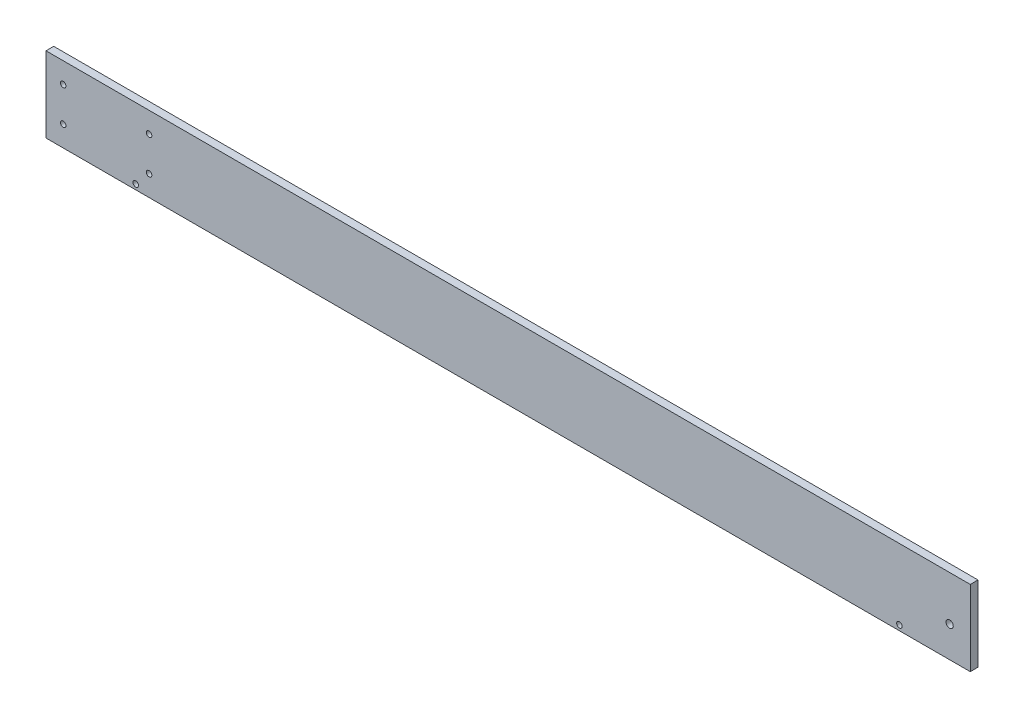
ISO-10303-21;
HEADER;
FILE_DESCRIPTION(('STEP AP214'),'2;1');
FILE_NAME('part.step','',(''),(''),'','','');
FILE_SCHEMA(('AUTOMOTIVE_DESIGN { 1 0 10303 214 1 1 1 1 }'));
ENDSEC;
DATA;
#1=APPLICATION_CONTEXT('core data for automotive mechanical design processes');
#2=APPLICATION_PROTOCOL_DEFINITION('international standard','automotive_design',2000,#1);
#3=PRODUCT_CONTEXT('',#1,'mechanical');
#4=PRODUCT('Part','Part','',(#3));
#5=PRODUCT_RELATED_PRODUCT_CATEGORY('part','',(#4));
#6=PRODUCT_DEFINITION_FORMATION('','',#4);
#7=PRODUCT_DEFINITION_CONTEXT('part definition',#1,'design');
#8=PRODUCT_DEFINITION('design','',#6,#7);
#9=PRODUCT_DEFINITION_SHAPE('','',#8);
#10=(LENGTH_UNIT() NAMED_UNIT(*) SI_UNIT(.MILLI.,.METRE.));
#11=(NAMED_UNIT(*) PLANE_ANGLE_UNIT() SI_UNIT($,.RADIAN.));
#12=(NAMED_UNIT(*) SI_UNIT($,.STERADIAN.) SOLID_ANGLE_UNIT());
#13=UNCERTAINTY_MEASURE_WITH_UNIT(LENGTH_MEASURE(1.E-05),#10,'distance_accuracy_value','');
#14=(GEOMETRIC_REPRESENTATION_CONTEXT(3) GLOBAL_UNCERTAINTY_ASSIGNED_CONTEXT((#13)) GLOBAL_UNIT_ASSIGNED_CONTEXT((#10,
#11,#12)) REPRESENTATION_CONTEXT('',''));
#15=CARTESIAN_POINT('',(0.,0.,0.));
#16=DIRECTION('',(0.,0.,1.));
#17=DIRECTION('',(1.,0.,0.));
#18=AXIS2_PLACEMENT_3D('',#15,#16,#17);
#19=CARTESIAN_POINT('',(0.,0.,4.5));
#20=DIRECTION('',(0.,0.,-1.));
#21=DIRECTION('',(-1.,0.,0.));
#22=AXIS2_PLACEMENT_3D('',#19,#20,#21);
#23=PLANE('',#22);
#24=DIRECTION('',(0.,1.,0.));
#25=VECTOR('',#24,1.);
#26=CARTESIAN_POINT('',(269.,-22.,4.5));
#27=LINE('',#26,#25);
#28=CARTESIAN_POINT('',(269.,-22.,4.5));
#29=VERTEX_POINT('',#28);
#30=CARTESIAN_POINT('',(269.,22.,4.5));
#31=VERTEX_POINT('',#30);
#32=EDGE_CURVE('E85',#29,#31,#27,.T.);
#33=ORIENTED_EDGE('',*,*,#32,.T.);
#34=DIRECTION('',(-1.,0.,0.));
#35=VECTOR('',#34,1.);
#36=CARTESIAN_POINT('',(-269.,22.,4.5));
#37=LINE('',#36,#35);
#38=CARTESIAN_POINT('',(-269.,22.,4.5));
#39=VERTEX_POINT('',#38);
#40=EDGE_CURVE('E80',#31,#39,#37,.T.);
#41=ORIENTED_EDGE('',*,*,#40,.T.);
#42=DIRECTION('',(0.,-1.,0.));
#43=VECTOR('',#42,1.);
#44=CARTESIAN_POINT('',(-269.,-22.,4.5));
#45=LINE('',#44,#43);
#46=CARTESIAN_POINT('',(-269.,-22.,4.5));
#47=VERTEX_POINT('',#46);
#48=EDGE_CURVE('E83',#39,#47,#45,.T.);
#49=ORIENTED_EDGE('',*,*,#48,.T.);
#50=DIRECTION('',(1.,0.,0.));
#51=VECTOR('',#50,1.);
#52=CARTESIAN_POINT('',(-269.,-22.,4.5));
#53=LINE('',#52,#51);
#54=EDGE_CURVE('E50',#47,#29,#53,.T.);
#55=ORIENTED_EDGE('',*,*,#54,.T.);
#56=EDGE_LOOP('',(#33,#41,#49,#55));
#57=FACE_BOUND('',#56,.T.);
#58=CARTESIAN_POINT('',(257.,-3.99999999999952,4.5));
#59=DIRECTION('',(0.,0.,1.));
#60=DIRECTION('',(1.,0.,0.));
#61=AXIS2_PLACEMENT_3D('',#58,#59,#60);
#62=CIRCLE('',#61,2.10000000000005);
#63=CARTESIAN_POINT('',(259.1,-3.99999999999952,4.5));
#64=VERTEX_POINT('',#63);
#65=EDGE_CURVE('E100',#64,#64,#62,.T.);
#66=ORIENTED_EDGE('',*,*,#65,.F.);
#67=EDGE_LOOP('',(#66));
#68=FACE_BOUND('',#67,.T.);
#69=CARTESIAN_POINT('',(-259.,10.,4.5));
#70=DIRECTION('',(0.,0.,1.));
#71=DIRECTION('',(1.,0.,0.));
#72=AXIS2_PLACEMENT_3D('',#69,#70,#71);
#73=CIRCLE('',#72,1.59999999999996);
#74=CARTESIAN_POINT('',(-257.4,10.,4.5));
#75=VERTEX_POINT('',#74);
#76=EDGE_CURVE('E115',#75,#75,#73,.T.);
#77=ORIENTED_EDGE('',*,*,#76,.F.);
#78=EDGE_LOOP('',(#77));
#79=FACE_BOUND('',#78,.T.);
#80=CARTESIAN_POINT('',(-209.,10.,4.5));
#81=DIRECTION('',(0.,0.,1.));
#82=DIRECTION('',(1.,0.,0.));
#83=AXIS2_PLACEMENT_3D('',#80,#81,#82);
#84=CIRCLE('',#83,1.59999999999996);
#85=CARTESIAN_POINT('',(-207.4,10.,4.5));
#86=VERTEX_POINT('',#85);
#87=EDGE_CURVE('E121',#86,#86,#84,.T.);
#88=ORIENTED_EDGE('',*,*,#87,.F.);
#89=EDGE_LOOP('',(#88));
#90=FACE_BOUND('',#89,.T.);
#91=CARTESIAN_POINT('',(-208.999999999999,-10.,4.5));
#92=DIRECTION('',(0.,0.,1.));
#93=DIRECTION('',(1.,0.,0.));
#94=AXIS2_PLACEMENT_3D('',#91,#92,#93);
#95=CIRCLE('',#94,1.59999999999996);
#96=CARTESIAN_POINT('',(-207.399999999999,-10.,4.5));
#97=VERTEX_POINT('',#96);
#98=EDGE_CURVE('E127',#97,#97,#95,.T.);
#99=ORIENTED_EDGE('',*,*,#98,.F.);
#100=EDGE_LOOP('',(#99));
#101=FACE_BOUND('',#100,.T.);
#102=CARTESIAN_POINT('',(-258.999999999999,-10.,4.5));
#103=DIRECTION('',(0.,0.,1.));
#104=DIRECTION('',(1.,0.,0.));
#105=AXIS2_PLACEMENT_3D('',#102,#103,#104);
#106=CIRCLE('',#105,1.59999999999996);
#107=CARTESIAN_POINT('',(-257.399999999999,-10.,4.5));
#108=VERTEX_POINT('',#107);
#109=EDGE_CURVE('E133',#108,#108,#106,.T.);
#110=ORIENTED_EDGE('',*,*,#109,.F.);
#111=EDGE_LOOP('',(#110));
#112=FACE_BOUND('',#111,.T.);
#113=CARTESIAN_POINT('',(227.75,-18.9999999999995,4.5));
#114=DIRECTION('',(0.,0.,1.));
#115=DIRECTION('',(1.,0.,0.));
#116=AXIS2_PLACEMENT_3D('',#113,#114,#115);
#117=CIRCLE('',#116,1.60000000000005);
#118=CARTESIAN_POINT('',(229.35,-18.9999999999995,4.5));
#119=VERTEX_POINT('',#118);
#120=EDGE_CURVE('E139',#119,#119,#117,.T.);
#121=ORIENTED_EDGE('',*,*,#120,.F.);
#122=EDGE_LOOP('',(#121));
#123=FACE_BOUND('',#122,.T.);
#124=CARTESIAN_POINT('',(-216.75,-19.0000000000007,4.5));
#125=DIRECTION('',(0.,0.,1.));
#126=DIRECTION('',(1.,0.,0.));
#127=AXIS2_PLACEMENT_3D('',#124,#125,#126);
#128=CIRCLE('',#127,1.60000000000005);
#129=CARTESIAN_POINT('',(-215.15,-19.0000000000007,4.5));
#130=VERTEX_POINT('',#129);
#131=EDGE_CURVE('E145',#130,#130,#128,.T.);
#132=ORIENTED_EDGE('',*,*,#131,.F.);
#133=EDGE_LOOP('',(#132));
#134=FACE_BOUND('',#133,.T.);
#135=ADVANCED_FACE('F33',(#57,#68,#79,#90,#101,#112,#123,#134),#23,.F.);
#136=CARTESIAN_POINT('',(0.,0.,0.));
#137=DIRECTION('',(0.,0.,-1.));
#138=DIRECTION('',(-1.,0.,0.));
#139=AXIS2_PLACEMENT_3D('',#136,#137,#138);
#140=PLANE('',#139);
#141=CARTESIAN_POINT('',(227.75,-18.9999999999995,0.));
#142=DIRECTION('',(0.,0.,1.));
#143=DIRECTION('',(1.,0.,0.));
#144=AXIS2_PLACEMENT_3D('',#141,#142,#143);
#145=CIRCLE('',#144,1.60000000000005);
#146=CARTESIAN_POINT('',(229.35,-18.9999999999995,0.));
#147=VERTEX_POINT('',#146);
#148=EDGE_CURVE('E142',#147,#147,#145,.T.);
#149=ORIENTED_EDGE('',*,*,#148,.T.);
#150=EDGE_LOOP('',(#149));
#151=FACE_BOUND('',#150,.T.);
#152=CARTESIAN_POINT('',(-208.999999999999,-10.,0.));
#153=DIRECTION('',(0.,0.,1.));
#154=DIRECTION('',(1.,0.,0.));
#155=AXIS2_PLACEMENT_3D('',#152,#153,#154);
#156=CIRCLE('',#155,1.59999999999996);
#157=CARTESIAN_POINT('',(-207.399999999999,-10.,0.));
#158=VERTEX_POINT('',#157);
#159=EDGE_CURVE('E130',#158,#158,#156,.T.);
#160=ORIENTED_EDGE('',*,*,#159,.T.);
#161=EDGE_LOOP('',(#160));
#162=FACE_BOUND('',#161,.T.);
#163=CARTESIAN_POINT('',(-259.,10.,0.));
#164=DIRECTION('',(0.,0.,1.));
#165=DIRECTION('',(1.,0.,0.));
#166=AXIS2_PLACEMENT_3D('',#163,#164,#165);
#167=CIRCLE('',#166,1.59999999999996);
#168=CARTESIAN_POINT('',(-257.4,10.,0.));
#169=VERTEX_POINT('',#168);
#170=EDGE_CURVE('E118',#169,#169,#167,.T.);
#171=ORIENTED_EDGE('',*,*,#170,.T.);
#172=EDGE_LOOP('',(#171));
#173=FACE_BOUND('',#172,.T.);
#174=DIRECTION('',(0.,1.,0.));
#175=VECTOR('',#174,1.);
#176=CARTESIAN_POINT('',(269.,-22.,0.));
#177=LINE('',#176,#175);
#178=CARTESIAN_POINT('',(269.,-22.,0.));
#179=VERTEX_POINT('',#178);
#180=CARTESIAN_POINT('',(269.,22.,0.));
#181=VERTEX_POINT('',#180);
#182=EDGE_CURVE('E97',#179,#181,#177,.T.);
#183=ORIENTED_EDGE('',*,*,#182,.F.);
#184=DIRECTION('',(1.,0.,0.));
#185=VECTOR('',#184,1.);
#186=CARTESIAN_POINT('',(-269.,-22.,0.));
#187=LINE('',#186,#185);
#188=CARTESIAN_POINT('',(-269.,-22.,0.));
#189=VERTEX_POINT('',#188);
#190=EDGE_CURVE('E73',#189,#179,#187,.T.);
#191=ORIENTED_EDGE('',*,*,#190,.F.);
#192=DIRECTION('',(0.,-1.,0.));
#193=VECTOR('',#192,1.);
#194=CARTESIAN_POINT('',(-269.,-22.,0.));
#195=LINE('',#194,#193);
#196=CARTESIAN_POINT('',(-269.,22.,0.));
#197=VERTEX_POINT('',#196);
#198=EDGE_CURVE('E67',#197,#189,#195,.T.);
#199=ORIENTED_EDGE('',*,*,#198,.F.);
#200=DIRECTION('',(-1.,0.,0.));
#201=VECTOR('',#200,1.);
#202=CARTESIAN_POINT('',(-269.,22.,0.));
#203=LINE('',#202,#201);
#204=EDGE_CURVE('E89',#181,#197,#203,.T.);
#205=ORIENTED_EDGE('',*,*,#204,.F.);
#206=EDGE_LOOP('',(#183,#191,#199,#205));
#207=FACE_BOUND('',#206,.T.);
#208=CARTESIAN_POINT('',(257.,-3.99999999999952,0.));
#209=DIRECTION('',(0.,0.,1.));
#210=DIRECTION('',(1.,0.,0.));
#211=AXIS2_PLACEMENT_3D('',#208,#209,#210);
#212=CIRCLE('',#211,2.10000000000005);
#213=CARTESIAN_POINT('',(259.1,-3.99999999999952,0.));
#214=VERTEX_POINT('',#213);
#215=EDGE_CURVE('E112',#214,#214,#212,.T.);
#216=ORIENTED_EDGE('',*,*,#215,.T.);
#217=EDGE_LOOP('',(#216));
#218=FACE_BOUND('',#217,.T.);
#219=CARTESIAN_POINT('',(-209.,10.,0.));
#220=DIRECTION('',(0.,0.,1.));
#221=DIRECTION('',(1.,0.,0.));
#222=AXIS2_PLACEMENT_3D('',#219,#220,#221);
#223=CIRCLE('',#222,1.59999999999996);
#224=CARTESIAN_POINT('',(-207.4,10.,0.));
#225=VERTEX_POINT('',#224);
#226=EDGE_CURVE('E124',#225,#225,#223,.T.);
#227=ORIENTED_EDGE('',*,*,#226,.T.);
#228=EDGE_LOOP('',(#227));
#229=FACE_BOUND('',#228,.T.);
#230=CARTESIAN_POINT('',(-258.999999999999,-10.,0.));
#231=DIRECTION('',(0.,0.,1.));
#232=DIRECTION('',(1.,0.,0.));
#233=AXIS2_PLACEMENT_3D('',#230,#231,#232);
#234=CIRCLE('',#233,1.59999999999996);
#235=CARTESIAN_POINT('',(-257.399999999999,-10.,0.));
#236=VERTEX_POINT('',#235);
#237=EDGE_CURVE('E136',#236,#236,#234,.T.);
#238=ORIENTED_EDGE('',*,*,#237,.T.);
#239=EDGE_LOOP('',(#238));
#240=FACE_BOUND('',#239,.T.);
#241=CARTESIAN_POINT('',(-216.75,-19.0000000000007,0.));
#242=DIRECTION('',(0.,0.,1.));
#243=DIRECTION('',(1.,0.,0.));
#244=AXIS2_PLACEMENT_3D('',#241,#242,#243);
#245=CIRCLE('',#244,1.60000000000005);
#246=CARTESIAN_POINT('',(-215.15,-19.0000000000007,0.));
#247=VERTEX_POINT('',#246);
#248=EDGE_CURVE('E148',#247,#247,#245,.T.);
#249=ORIENTED_EDGE('',*,*,#248,.T.);
#250=EDGE_LOOP('',(#249));
#251=FACE_BOUND('',#250,.T.);
#252=ADVANCED_FACE('F108',(#151,#162,#173,#207,#218,#229,#240,#251),#140,.T.);
#253=CARTESIAN_POINT('',(269.,-22.,4.5));
#254=DIRECTION('',(-1.,0.,0.));
#255=DIRECTION('',(0.,0.,1.));
#256=AXIS2_PLACEMENT_3D('',#253,#254,#255);
#257=PLANE('',#256);
#258=ORIENTED_EDGE('',*,*,#182,.T.);
#259=DIRECTION('',(0.,0.,-1.));
#260=VECTOR('',#259,1.);
#261=CARTESIAN_POINT('',(269.,22.,4.5));
#262=LINE('',#261,#260);
#263=EDGE_CURVE('E11',#31,#181,#262,.T.);
#264=ORIENTED_EDGE('',*,*,#263,.F.);
#265=ORIENTED_EDGE('',*,*,#32,.F.);
#266=DIRECTION('',(0.,0.,-1.));
#267=VECTOR('',#266,1.);
#268=CARTESIAN_POINT('',(269.,-22.,4.5));
#269=LINE('',#268,#267);
#270=EDGE_CURVE('E93',#29,#179,#269,.T.);
#271=ORIENTED_EDGE('',*,*,#270,.T.);
#272=EDGE_LOOP('',(#258,#264,#265,#271));
#273=FACE_BOUND('',#272,.T.);
#274=ADVANCED_FACE('F35',(#273),#257,.F.);
#275=CARTESIAN_POINT('',(-269.,22.,4.5));
#276=DIRECTION('',(0.,-1.,0.));
#277=DIRECTION('',(1.,0.,0.));
#278=AXIS2_PLACEMENT_3D('',#275,#276,#277);
#279=PLANE('',#278);
#280=ORIENTED_EDGE('',*,*,#204,.T.);
#281=DIRECTION('',(0.,0.,-1.));
#282=VECTOR('',#281,1.);
#283=CARTESIAN_POINT('',(-269.,22.,4.5));
#284=LINE('',#283,#282);
#285=EDGE_CURVE('E42',#39,#197,#284,.T.);
#286=ORIENTED_EDGE('',*,*,#285,.F.);
#287=ORIENTED_EDGE('',*,*,#40,.F.);
#288=ORIENTED_EDGE('',*,*,#263,.T.);
#289=EDGE_LOOP('',(#280,#286,#287,#288));
#290=FACE_BOUND('',#289,.T.);
#291=ADVANCED_FACE('F88',(#290),#279,.F.);
#292=CARTESIAN_POINT('',(-269.,-22.,4.5));
#293=DIRECTION('',(1.,0.,0.));
#294=DIRECTION('',(0.,0.,-1.));
#295=AXIS2_PLACEMENT_3D('',#292,#293,#294);
#296=PLANE('',#295);
#297=ORIENTED_EDGE('',*,*,#198,.T.);
#298=DIRECTION('',(0.,0.,-1.));
#299=VECTOR('',#298,1.);
#300=CARTESIAN_POINT('',(-269.,-22.,4.5));
#301=LINE('',#300,#299);
#302=EDGE_CURVE('E90',#47,#189,#301,.T.);
#303=ORIENTED_EDGE('',*,*,#302,.F.);
#304=ORIENTED_EDGE('',*,*,#48,.F.);
#305=ORIENTED_EDGE('',*,*,#285,.T.);
#306=EDGE_LOOP('',(#297,#303,#304,#305));
#307=FACE_BOUND('',#306,.T.);
#308=ADVANCED_FACE('F91',(#307),#296,.F.);
#309=CARTESIAN_POINT('',(-269.,-22.,4.5));
#310=DIRECTION('',(0.,1.,0.));
#311=DIRECTION('',(-1.,0.,0.));
#312=AXIS2_PLACEMENT_3D('',#309,#310,#311);
#313=PLANE('',#312);
#314=ORIENTED_EDGE('',*,*,#190,.T.);
#315=ORIENTED_EDGE('',*,*,#270,.F.);
#316=ORIENTED_EDGE('',*,*,#54,.F.);
#317=ORIENTED_EDGE('',*,*,#302,.T.);
#318=EDGE_LOOP('',(#314,#315,#316,#317));
#319=FACE_BOUND('',#318,.T.);
#320=ADVANCED_FACE('F105',(#319),#313,.F.);
#321=CARTESIAN_POINT('',(257.,-3.99999999999952,4.5));
#322=DIRECTION('',(0.,0.,-1.));
#323=DIRECTION('',(-1.,0.,0.));
#324=AXIS2_PLACEMENT_3D('',#321,#322,#323);
#325=CYLINDRICAL_SURFACE('',#324,2.10000000000005);
#326=ORIENTED_EDGE('',*,*,#65,.T.);
#327=EDGE_LOOP('',(#326));
#328=FACE_BOUND('',#327,.T.);
#329=ORIENTED_EDGE('',*,*,#215,.F.);
#330=EDGE_LOOP('',(#329));
#331=FACE_BOUND('',#330,.T.);
#332=ADVANCED_FACE('F165',(#328,#331),#325,.F.);
#333=CARTESIAN_POINT('',(-259.,10.,4.5));
#334=DIRECTION('',(0.,0.,-1.));
#335=DIRECTION('',(-1.,0.,0.));
#336=AXIS2_PLACEMENT_3D('',#333,#334,#335);
#337=CYLINDRICAL_SURFACE('',#336,1.59999999999996);
#338=ORIENTED_EDGE('',*,*,#76,.T.);
#339=EDGE_LOOP('',(#338));
#340=FACE_BOUND('',#339,.T.);
#341=ORIENTED_EDGE('',*,*,#170,.F.);
#342=EDGE_LOOP('',(#341));
#343=FACE_BOUND('',#342,.T.);
#344=ADVANCED_FACE('F211',(#340,#343),#337,.F.);
#345=CARTESIAN_POINT('',(-209.,10.,4.5));
#346=DIRECTION('',(0.,0.,-1.));
#347=DIRECTION('',(-1.,0.,0.));
#348=AXIS2_PLACEMENT_3D('',#345,#346,#347);
#349=CYLINDRICAL_SURFACE('',#348,1.59999999999996);
#350=ORIENTED_EDGE('',*,*,#87,.T.);
#351=EDGE_LOOP('',(#350));
#352=FACE_BOUND('',#351,.T.);
#353=ORIENTED_EDGE('',*,*,#226,.F.);
#354=EDGE_LOOP('',(#353));
#355=FACE_BOUND('',#354,.T.);
#356=ADVANCED_FACE('F219',(#352,#355),#349,.F.);
#357=CARTESIAN_POINT('',(-208.999999999999,-10.,4.5));
#358=DIRECTION('',(0.,0.,-1.));
#359=DIRECTION('',(-1.,0.,0.));
#360=AXIS2_PLACEMENT_3D('',#357,#358,#359);
#361=CYLINDRICAL_SURFACE('',#360,1.59999999999996);
#362=ORIENTED_EDGE('',*,*,#98,.T.);
#363=EDGE_LOOP('',(#362));
#364=FACE_BOUND('',#363,.T.);
#365=ORIENTED_EDGE('',*,*,#159,.F.);
#366=EDGE_LOOP('',(#365));
#367=FACE_BOUND('',#366,.T.);
#368=ADVANCED_FACE('F227',(#364,#367),#361,.F.);
#369=CARTESIAN_POINT('',(-258.999999999999,-10.,4.5));
#370=DIRECTION('',(0.,0.,-1.));
#371=DIRECTION('',(-1.,0.,0.));
#372=AXIS2_PLACEMENT_3D('',#369,#370,#371);
#373=CYLINDRICAL_SURFACE('',#372,1.59999999999996);
#374=ORIENTED_EDGE('',*,*,#109,.T.);
#375=EDGE_LOOP('',(#374));
#376=FACE_BOUND('',#375,.T.);
#377=ORIENTED_EDGE('',*,*,#237,.F.);
#378=EDGE_LOOP('',(#377));
#379=FACE_BOUND('',#378,.T.);
#380=ADVANCED_FACE('F236',(#376,#379),#373,.F.);
#381=CARTESIAN_POINT('',(227.75,-18.9999999999995,4.5));
#382=DIRECTION('',(0.,0.,-1.));
#383=DIRECTION('',(-1.,0.,0.));
#384=AXIS2_PLACEMENT_3D('',#381,#382,#383);
#385=CYLINDRICAL_SURFACE('',#384,1.60000000000005);
#386=ORIENTED_EDGE('',*,*,#120,.T.);
#387=EDGE_LOOP('',(#386));
#388=FACE_BOUND('',#387,.T.);
#389=ORIENTED_EDGE('',*,*,#148,.F.);
#390=EDGE_LOOP('',(#389));
#391=FACE_BOUND('',#390,.T.);
#392=ADVANCED_FACE('F245',(#388,#391),#385,.F.);
#393=CARTESIAN_POINT('',(-216.75,-19.0000000000007,4.5));
#394=DIRECTION('',(0.,0.,-1.));
#395=DIRECTION('',(-1.,0.,0.));
#396=AXIS2_PLACEMENT_3D('',#393,#394,#395);
#397=CYLINDRICAL_SURFACE('',#396,1.60000000000005);
#398=ORIENTED_EDGE('',*,*,#131,.T.);
#399=EDGE_LOOP('',(#398));
#400=FACE_BOUND('',#399,.T.);
#401=ORIENTED_EDGE('',*,*,#248,.F.);
#402=EDGE_LOOP('',(#401));
#403=FACE_BOUND('',#402,.T.);
#404=ADVANCED_FACE('F154',(#400,#403),#397,.F.);
#405=CLOSED_SHELL('',(#135,#252,#274,#291,#308,#320,#332,#344,#356,#368,#380,#392,#404));
#406=MANIFOLD_SOLID_BREP('B2',#405);
#407=ADVANCED_BREP_SHAPE_REPRESENTATION('',(#18,#406),#14);
#408=SHAPE_DEFINITION_REPRESENTATION(#9,#407);
ENDSEC;
END-ISO-10303-21;
